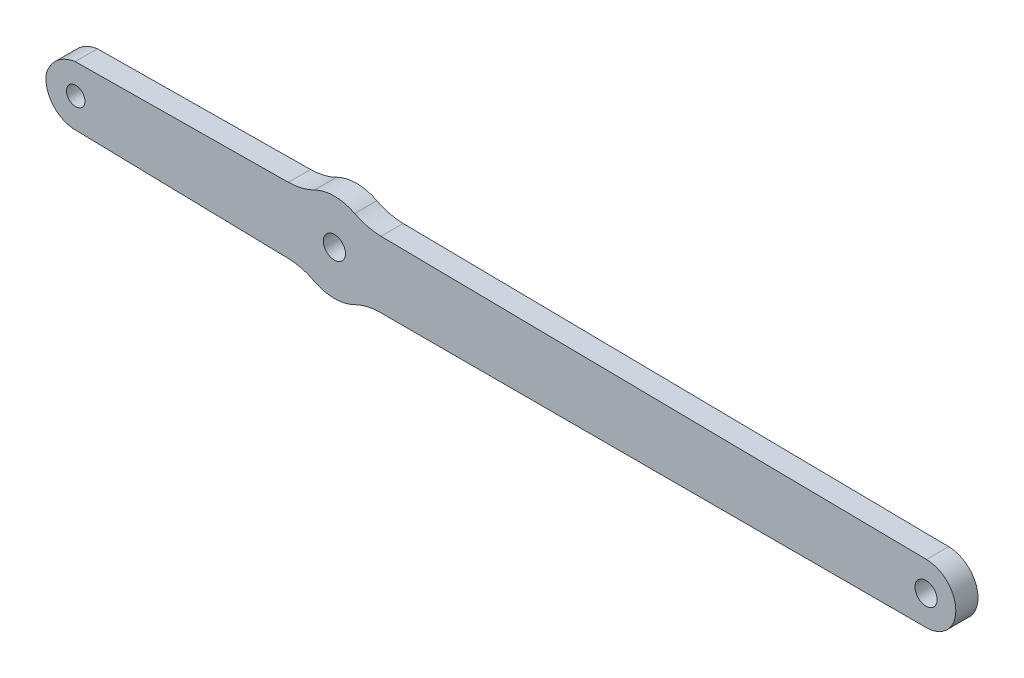
ISO-10303-21;
HEADER;
FILE_DESCRIPTION(('STEP AP214'),'2;1');
FILE_NAME('part.step','',(''),(''),'','','');
FILE_SCHEMA(('AUTOMOTIVE_DESIGN { 1 0 10303 214 1 1 1 1 }'));
ENDSEC;
DATA;
#1=APPLICATION_CONTEXT('core data for automotive mechanical design processes');
#2=APPLICATION_PROTOCOL_DEFINITION('international standard','automotive_design',2000,#1);
#3=PRODUCT_CONTEXT('',#1,'mechanical');
#4=PRODUCT('Part','Part','',(#3));
#5=PRODUCT_RELATED_PRODUCT_CATEGORY('part','',(#4));
#6=PRODUCT_DEFINITION_FORMATION('','',#4);
#7=PRODUCT_DEFINITION_CONTEXT('part definition',#1,'design');
#8=PRODUCT_DEFINITION('design','',#6,#7);
#9=PRODUCT_DEFINITION_SHAPE('','',#8);
#10=(LENGTH_UNIT() NAMED_UNIT(*) SI_UNIT(.MILLI.,.METRE.));
#11=(NAMED_UNIT(*) PLANE_ANGLE_UNIT() SI_UNIT($,.RADIAN.));
#12=(NAMED_UNIT(*) SI_UNIT($,.STERADIAN.) SOLID_ANGLE_UNIT());
#13=UNCERTAINTY_MEASURE_WITH_UNIT(LENGTH_MEASURE(1.E-05),#10,'distance_accuracy_value','');
#14=(GEOMETRIC_REPRESENTATION_CONTEXT(3) GLOBAL_UNCERTAINTY_ASSIGNED_CONTEXT((#13)) GLOBAL_UNIT_ASSIGNED_CONTEXT((#10,
#11,#12)) REPRESENTATION_CONTEXT('',''));
#15=CARTESIAN_POINT('',(0.,0.,0.));
#16=DIRECTION('',(0.,0.,1.));
#17=DIRECTION('',(1.,0.,0.));
#18=AXIS2_PLACEMENT_3D('',#15,#16,#17);
#19=CARTESIAN_POINT('',(2440.21296104026,1644.52332805151,3.));
#20=DIRECTION('',(0.,0.,1.));
#21=DIRECTION('',(1.,0.,0.));
#22=AXIS2_PLACEMENT_3D('',#19,#20,#21);
#23=PLANE('',#22);
#24=CARTESIAN_POINT('',(2325.21536104526,1645.27942804984,3.));
#25=DIRECTION('',(0.,0.,1.));
#26=DIRECTION('',(1.,0.,0.));
#27=AXIS2_PLACEMENT_3D('',#24,#25,#26);
#28=CIRCLE('',#27,1.25000000000008);
#29=CARTESIAN_POINT('',(2326.46536104526,1645.27942804984,3.));
#30=VERTEX_POINT('',#29);
#31=EDGE_CURVE('E486',#30,#30,#28,.T.);
#32=ORIENTED_EDGE('',*,*,#31,.F.);
#33=EDGE_LOOP('',(#32));
#34=FACE_BOUND('',#33,.T.);
#35=DIRECTION('',(0.9999999979286,6.43645912730383E-05,0.));
#36=VECTOR('',#35,1.);
#37=CARTESIAN_POINT('',(2366.44159291692,1640.51895092669,3.));
#38=LINE('',#37,#36);
#39=CARTESIAN_POINT('',(2366.44159291692,1640.51895092669,3.));
#40=VERTEX_POINT('',#39);
#41=CARTESIAN_POINT('',(2440.239407081,1640.52370089284,3.));
#42=VERTEX_POINT('',#41);
#43=EDGE_CURVE('E114',#40,#42,#38,.T.);
#44=ORIENTED_EDGE('',*,*,#43,.T.);
#45=CARTESIAN_POINT('',(2440.21296104026,1644.52332805151,3.));
#46=DIRECTION('',(0.,0.,1.));
#47=DIRECTION('',(1.,0.,0.));
#48=AXIS2_PLACEMENT_3D('',#45,#46,#47);
#49=CIRCLE('',#48,3.99971458999516);
#50=CARTESIAN_POINT('',(2440.23908453395,1648.52295732989,3.));
#51=VERTEX_POINT('',#50);
#52=EDGE_CURVE('E301',#42,#51,#49,.T.);
#53=ORIENTED_EDGE('',*,*,#52,.T.);
#54=DIRECTION('',(-0.999914327574007,0.0130895955713575,0.));
#55=VECTOR('',#54,1.);
#56=CARTESIAN_POINT('',(2440.23908453395,1648.52295732989,3.));
#57=LINE('',#56,#55);
#58=CARTESIAN_POINT('',(2366.50000248119,1649.48825479114,3.));
#59=VERTEX_POINT('',#58);
#60=EDGE_CURVE('E250',#51,#59,#57,.T.);
#61=ORIENTED_EDGE('',*,*,#60,.T.);
#62=CARTESIAN_POINT('',(2366.6049197581,1657.48821129003,3.));
#63=DIRECTION('',(0.,0.,-1.));
#64=DIRECTION('',(1.,0.,0.));
#65=AXIS2_PLACEMENT_3D('',#62,#63,#64);
#66=CIRCLE('',#65,8.00064445024119);
#67=CARTESIAN_POINT('',(2362.93823396365,1650.37725306319,3.));
#68=VERTEX_POINT('',#67);
#69=EDGE_CURVE('E270',#59,#68,#66,.T.);
#70=ORIENTED_EDGE('',*,*,#69,.T.);
#71=CARTESIAN_POINT('',(2360.1883368183,1645.04491457963,3.));
#72=DIRECTION('',(0.,0.,1.));
#73=DIRECTION('',(1.,0.,0.));
#74=AXIS2_PLACEMENT_3D('',#71,#72,#73);
#75=CIRCLE('',#74,5.99964732407257);
#76=CARTESIAN_POINT('',(2357.48930650792,1650.40317954106,3.));
#77=VERTEX_POINT('',#76);
#78=EDGE_CURVE('E266',#68,#77,#75,.T.);
#79=ORIENTED_EDGE('',*,*,#78,.T.);
#80=CARTESIAN_POINT('',(2353.88652881612,1657.56467152541,3.));
#81=DIRECTION('',(0.,0.,-1.));
#82=DIRECTION('',(1.,0.,0.));
#83=AXIS2_PLACEMENT_3D('',#80,#81,#82);
#84=CIRCLE('',#83,8.01666854363158);
#85=CARTESIAN_POINT('',(2353.96721616185,1649.548409049,3.));
#86=VERTEX_POINT('',#85);
#87=EDGE_CURVE('E269',#77,#86,#84,.T.);
#88=ORIENTED_EDGE('',*,*,#87,.T.);
#89=DIRECTION('',(-0.999954125619551,-0.00957844749632703,0.));
#90=VECTOR('',#89,1.);
#91=CARTESIAN_POINT('',(2353.96721616185,1649.548409049,3.));
#92=LINE('',#91,#90);
#93=CARTESIAN_POINT('',(2325.15083428632,1649.27238018552,3.));
#94=VERTEX_POINT('',#93);
#95=EDGE_CURVE('E274',#86,#94,#92,.T.);
#96=ORIENTED_EDGE('',*,*,#95,.T.);
#97=CARTESIAN_POINT('',(2325.78889121728,1644.5594471077,3.));
#98=DIRECTION('',(0.,0.,1.));
#99=DIRECTION('',(1.,0.,0.));
#100=AXIS2_PLACEMENT_3D('',#97,#98,#99);
#101=CIRCLE('',#100,4.75592838919185);
#102=CARTESIAN_POINT('',(2321.25498951292,1645.99561916505,3.));
#103=VERTEX_POINT('',#102);
#104=EDGE_CURVE('E281',#94,#103,#101,.T.);
#105=ORIENTED_EDGE('',*,*,#104,.T.);
#106=CARTESIAN_POINT('',(2325.18909853075,1645.27255959542,3.));
#107=DIRECTION('',(0.,0.,1.));
#108=DIRECTION('',(1.,0.,0.));
#109=AXIS2_PLACEMENT_3D('',#106,#107,#108);
#110=CIRCLE('',#109,4.00000361317313);
#111=CARTESIAN_POINT('',(2325.09872872289,1641.27357694939,3.));
#112=VERTEX_POINT('',#111);
#113=EDGE_CURVE('E284',#103,#112,#110,.T.);
#114=ORIENTED_EDGE('',*,*,#113,.T.);
#115=DIRECTION('',(0.999744437235561,-0.0226066409833889,0.));
#116=VECTOR('',#115,1.);
#117=CARTESIAN_POINT('',(2325.09872872289,1641.27357694939,3.));
#118=LINE('',#117,#116);
#119=CARTESIAN_POINT('',(2353.90906947594,1640.62210542752,3.));
#120=VERTEX_POINT('',#119);
#121=EDGE_CURVE('E149',#112,#120,#118,.T.);
#122=ORIENTED_EDGE('',*,*,#121,.T.);
#123=CARTESIAN_POINT('',(2353.84450791812,1633.07764565918,3.));
#124=DIRECTION('',(0.,0.,-1.));
#125=DIRECTION('',(1.,0.,0.));
#126=AXIS2_PLACEMENT_3D('',#123,#124,#125);
#127=CIRCLE('',#126,7.54473600537389);
#128=CARTESIAN_POINT('',(2357.41978135214,1639.72147446965,3.));
#129=VERTEX_POINT('',#128);
#130=EDGE_CURVE('E143',#120,#129,#127,.T.);
#131=ORIENTED_EDGE('',*,*,#130,.T.);
#132=CARTESIAN_POINT('',(2360.18834368888,1645.04457088387,3.));
#133=DIRECTION('',(0.,0.,1.));
#134=DIRECTION('',(1.,0.,0.));
#135=AXIS2_PLACEMENT_3D('',#132,#133,#134);
#136=CIRCLE('',#135,6.00002440391097);
#137=CARTESIAN_POINT('',(2362.86855878802,1639.67644831915,3.));
#138=VERTEX_POINT('',#137);
#139=EDGE_CURVE('E147',#129,#138,#136,.T.);
#140=ORIENTED_EDGE('',*,*,#139,.T.);
#141=CARTESIAN_POINT('',(2366.44225206849,1632.51832650636,3.));
#142=DIRECTION('',(0.,0.,-1.));
#143=DIRECTION('',(1.,0.,0.));
#144=AXIS2_PLACEMENT_3D('',#141,#142,#143);
#145=CIRCLE('',#144,8.00062444748284);
#146=EDGE_CURVE('E57',#138,#40,#145,.T.);
#147=ORIENTED_EDGE('',*,*,#146,.T.);
#148=EDGE_LOOP('',(#44,#53,#61,#70,#79,#88,#96,#105,#114,#122,#131,#140,#147));
#149=FACE_BOUND('',#148,.T.);
#150=CARTESIAN_POINT('',(2440.18667689334,1644.52335089235,3.));
#151=DIRECTION('',(0.,0.,1.));
#152=DIRECTION('',(1.,0.,0.));
#153=AXIS2_PLACEMENT_3D('',#150,#151,#152);
#154=CIRCLE('',#153,1.50000000000011);
#155=CARTESIAN_POINT('',(2441.68667689334,1644.52335089235,3.));
#156=VERTEX_POINT('',#155);
#157=EDGE_CURVE('E174',#156,#156,#154,.T.);
#158=ORIENTED_EDGE('',*,*,#157,.F.);
#159=EDGE_LOOP('',(#158));
#160=FACE_BOUND('',#159,.T.);
#161=CARTESIAN_POINT('',(2360.18839598004,1645.04459046653,3.));
#162=DIRECTION('',(0.,0.,1.));
#163=DIRECTION('',(1.,0.,0.));
#164=AXIS2_PLACEMENT_3D('',#161,#162,#163);
#165=CIRCLE('',#164,1.50000000000011);
#166=CARTESIAN_POINT('',(2361.68839598004,1645.04459046653,3.));
#167=VERTEX_POINT('',#166);
#168=EDGE_CURVE('E475',#167,#167,#165,.T.);
#169=ORIENTED_EDGE('',*,*,#168,.F.);
#170=EDGE_LOOP('',(#169));
#171=FACE_BOUND('',#170,.T.);
#172=ADVANCED_FACE('F39',(#34,#149,#160,#171),#23,.T.);
#173=CARTESIAN_POINT('',(2440.21296104026,1644.52332805151,0.));
#174=DIRECTION('',(0.,0.,1.));
#175=DIRECTION('',(1.,0.,0.));
#176=AXIS2_PLACEMENT_3D('',#173,#174,#175);
#177=PLANE('',#176);
#178=DIRECTION('',(0.9999999979286,6.43645909722801E-05,0.));
#179=VECTOR('',#178,1.);
#180=CARTESIAN_POINT('',(2432.73939323316,1640.52321815752,0.));
#181=LINE('',#180,#179);
#182=CARTESIAN_POINT('',(2366.44159291692,1640.51895092669,0.));
#183=VERTEX_POINT('',#182);
#184=CARTESIAN_POINT('',(2440.239407081,1640.52370089284,0.));
#185=VERTEX_POINT('',#184);
#186=EDGE_CURVE('E108',#183,#185,#181,.T.);
#187=ORIENTED_EDGE('',*,*,#186,.F.);
#188=CARTESIAN_POINT('',(2366.44225206849,1632.51832650636,0.));
#189=DIRECTION('',(0.,0.,-1.));
#190=DIRECTION('',(1.,0.,0.));
#191=AXIS2_PLACEMENT_3D('',#188,#189,#190);
#192=CIRCLE('',#191,8.00062444748284);
#193=CARTESIAN_POINT('',(2362.86855878802,1639.67644831915,0.));
#194=VERTEX_POINT('',#193);
#195=EDGE_CURVE('E205',#194,#183,#192,.T.);
#196=ORIENTED_EDGE('',*,*,#195,.F.);
#197=CARTESIAN_POINT('',(2360.18834368888,1645.04457088387,0.));
#198=DIRECTION('',(0.,0.,1.));
#199=DIRECTION('',(1.,0.,0.));
#200=AXIS2_PLACEMENT_3D('',#197,#198,#199);
#201=CIRCLE('',#200,6.00002440391097);
#202=CARTESIAN_POINT('',(2357.41978135214,1639.72147446965,0.));
#203=VERTEX_POINT('',#202);
#204=EDGE_CURVE('E101',#203,#194,#201,.T.);
#205=ORIENTED_EDGE('',*,*,#204,.F.);
#206=CARTESIAN_POINT('',(2353.84450791812,1633.07764565918,0.));
#207=DIRECTION('',(0.,0.,-1.));
#208=DIRECTION('',(1.,0.,0.));
#209=AXIS2_PLACEMENT_3D('',#206,#207,#208);
#210=CIRCLE('',#209,7.54473600537389);
#211=CARTESIAN_POINT('',(2353.90906947594,1640.62210542752,0.));
#212=VERTEX_POINT('',#211);
#213=EDGE_CURVE('E158',#212,#203,#210,.T.);
#214=ORIENTED_EDGE('',*,*,#213,.F.);
#215=DIRECTION('',(0.999744437235561,-0.0226066409833889,0.));
#216=VECTOR('',#215,1.);
#217=CARTESIAN_POINT('',(2325.09872872289,1641.27357694939,0.));
#218=LINE('',#217,#216);
#219=CARTESIAN_POINT('',(2325.09872872289,1641.27357694939,0.));
#220=VERTEX_POINT('',#219);
#221=EDGE_CURVE('E198',#220,#212,#218,.T.);
#222=ORIENTED_EDGE('',*,*,#221,.F.);
#223=CARTESIAN_POINT('',(2325.18909853075,1645.27255959542,0.));
#224=DIRECTION('',(0.,0.,1.));
#225=DIRECTION('',(1.,0.,0.));
#226=AXIS2_PLACEMENT_3D('',#223,#224,#225);
#227=CIRCLE('',#226,4.00000361317313);
#228=CARTESIAN_POINT('',(2321.25498951292,1645.99561916505,0.));
#229=VERTEX_POINT('',#228);
#230=EDGE_CURVE('E195',#229,#220,#227,.T.);
#231=ORIENTED_EDGE('',*,*,#230,.F.);
#232=CARTESIAN_POINT('',(2325.78889121728,1644.5594471077,0.));
#233=DIRECTION('',(0.,0.,1.));
#234=DIRECTION('',(1.,0.,0.));
#235=AXIS2_PLACEMENT_3D('',#232,#233,#234);
#236=CIRCLE('',#235,4.75592838919185);
#237=CARTESIAN_POINT('',(2325.15083428632,1649.27238018552,0.));
#238=VERTEX_POINT('',#237);
#239=EDGE_CURVE('E192',#238,#229,#236,.T.);
#240=ORIENTED_EDGE('',*,*,#239,.F.);
#241=DIRECTION('',(-0.999954125619551,-0.00957844749632703,0.));
#242=VECTOR('',#241,1.);
#243=CARTESIAN_POINT('',(2353.96721616185,1649.548409049,0.));
#244=LINE('',#243,#242);
#245=CARTESIAN_POINT('',(2353.96721616185,1649.548409049,0.));
#246=VERTEX_POINT('',#245);
#247=EDGE_CURVE('E189',#246,#238,#244,.T.);
#248=ORIENTED_EDGE('',*,*,#247,.F.);
#249=CARTESIAN_POINT('',(2353.88652881612,1657.56467152541,0.));
#250=DIRECTION('',(0.,0.,-1.));
#251=DIRECTION('',(1.,0.,0.));
#252=AXIS2_PLACEMENT_3D('',#249,#250,#251);
#253=CIRCLE('',#252,8.01666854363158);
#254=CARTESIAN_POINT('',(2357.48930650792,1650.40317954106,0.));
#255=VERTEX_POINT('',#254);
#256=EDGE_CURVE('E186',#255,#246,#253,.T.);
#257=ORIENTED_EDGE('',*,*,#256,.F.);
#258=CARTESIAN_POINT('',(2360.1883368183,1645.04491457963,0.));
#259=DIRECTION('',(0.,0.,1.));
#260=DIRECTION('',(1.,0.,0.));
#261=AXIS2_PLACEMENT_3D('',#258,#259,#260);
#262=CIRCLE('',#261,5.99964732407257);
#263=CARTESIAN_POINT('',(2362.93823396365,1650.37725306319,0.));
#264=VERTEX_POINT('',#263);
#265=EDGE_CURVE('E183',#264,#255,#262,.T.);
#266=ORIENTED_EDGE('',*,*,#265,.F.);
#267=CARTESIAN_POINT('',(2366.6049197581,1657.48821129003,0.));
#268=DIRECTION('',(0.,0.,-1.));
#269=DIRECTION('',(1.,0.,0.));
#270=AXIS2_PLACEMENT_3D('',#267,#268,#269);
#271=CIRCLE('',#270,8.00064445024119);
#272=CARTESIAN_POINT('',(2366.50000248119,1649.48825479114,0.));
#273=VERTEX_POINT('',#272);
#274=EDGE_CURVE('E180',#273,#264,#271,.T.);
#275=ORIENTED_EDGE('',*,*,#274,.F.);
#276=DIRECTION('',(-0.999914327574007,0.0130895955713575,0.));
#277=VECTOR('',#276,1.);
#278=CARTESIAN_POINT('',(2440.23908453395,1648.52295732989,0.));
#279=LINE('',#278,#277);
#280=CARTESIAN_POINT('',(2440.23908453395,1648.52295732989,0.));
#281=VERTEX_POINT('',#280);
#282=EDGE_CURVE('E177',#281,#273,#279,.T.);
#283=ORIENTED_EDGE('',*,*,#282,.F.);
#284=CARTESIAN_POINT('',(2440.21296104026,1644.52332805151,0.));
#285=DIRECTION('',(0.,0.,1.));
#286=DIRECTION('',(1.,0.,0.));
#287=AXIS2_PLACEMENT_3D('',#284,#285,#286);
#288=CIRCLE('',#287,3.99971458999516);
#289=EDGE_CURVE('E173',#185,#281,#288,.T.);
#290=ORIENTED_EDGE('',*,*,#289,.F.);
#291=EDGE_LOOP('',(#187,#196,#205,#214,#222,#231,#240,#248,#257,#266,#275,#283,#290));
#292=FACE_BOUND('',#291,.T.);
#293=CARTESIAN_POINT('',(2440.18667689334,1644.52335089235,0.));
#294=DIRECTION('',(0.,0.,1.));
#295=DIRECTION('',(1.,0.,0.));
#296=AXIS2_PLACEMENT_3D('',#293,#294,#295);
#297=CIRCLE('',#296,1.50000000000011);
#298=CARTESIAN_POINT('',(2441.68667689334,1644.52335089235,0.));
#299=VERTEX_POINT('',#298);
#300=EDGE_CURVE('E306',#299,#299,#297,.T.);
#301=ORIENTED_EDGE('',*,*,#300,.T.);
#302=EDGE_LOOP('',(#301));
#303=FACE_BOUND('',#302,.T.);
#304=CARTESIAN_POINT('',(2325.21536104526,1645.27942804984,0.));
#305=DIRECTION('',(0.,0.,1.));
#306=DIRECTION('',(1.,0.,0.));
#307=AXIS2_PLACEMENT_3D('',#304,#305,#306);
#308=CIRCLE('',#307,1.25000000000008);
#309=CARTESIAN_POINT('',(2326.46536104526,1645.27942804984,0.));
#310=VERTEX_POINT('',#309);
#311=EDGE_CURVE('E483',#310,#310,#308,.T.);
#312=ORIENTED_EDGE('',*,*,#311,.T.);
#313=EDGE_LOOP('',(#312));
#314=FACE_BOUND('',#313,.T.);
#315=CARTESIAN_POINT('',(2360.18839598004,1645.04459046653,0.));
#316=DIRECTION('',(0.,0.,1.));
#317=DIRECTION('',(1.,0.,0.));
#318=AXIS2_PLACEMENT_3D('',#315,#316,#317);
#319=CIRCLE('',#318,1.50000000000011);
#320=CARTESIAN_POINT('',(2361.68839598004,1645.04459046653,0.));
#321=VERTEX_POINT('',#320);
#322=EDGE_CURVE('E478',#321,#321,#319,.T.);
#323=ORIENTED_EDGE('',*,*,#322,.T.);
#324=EDGE_LOOP('',(#323));
#325=FACE_BOUND('',#324,.T.);
#326=ADVANCED_FACE('F254',(#292,#303,#314,#325),#177,.F.);
#327=CARTESIAN_POINT('',(2432.73939323316,1640.52321815752,3.));
#328=DIRECTION('',(-6.43645909722801E-05,0.9999999979286,0.));
#329=DIRECTION('',(-0.9999999979286,-6.43645909722801E-05,0.));
#330=AXIS2_PLACEMENT_3D('',#327,#328,#329);
#331=PLANE('',#330);
#332=ORIENTED_EDGE('',*,*,#186,.T.);
#333=DIRECTION('',(0.,0.,-1.));
#334=VECTOR('',#333,1.);
#335=CARTESIAN_POINT('',(2440.239407081,1640.52370089284,3.));
#336=LINE('',#335,#334);
#337=EDGE_CURVE('E11',#42,#185,#336,.T.);
#338=ORIENTED_EDGE('',*,*,#337,.F.);
#339=ORIENTED_EDGE('',*,*,#43,.F.);
#340=DIRECTION('',(0.,0.,-1.));
#341=VECTOR('',#340,1.);
#342=CARTESIAN_POINT('',(2366.44159291692,1640.51895092669,3.));
#343=LINE('',#342,#341);
#344=EDGE_CURVE('E167',#40,#183,#343,.T.);
#345=ORIENTED_EDGE('',*,*,#344,.T.);
#346=EDGE_LOOP('',(#332,#338,#339,#345));
#347=FACE_BOUND('',#346,.T.);
#348=ADVANCED_FACE('F41',(#347),#331,.F.);
#349=CARTESIAN_POINT('',(2440.21296104026,1644.52332805151,3.));
#350=DIRECTION('',(0.,0.,-1.));
#351=DIRECTION('',(-1.,0.,0.));
#352=AXIS2_PLACEMENT_3D('',#349,#350,#351);
#353=CYLINDRICAL_SURFACE('',#352,3.99971458999516);
#354=ORIENTED_EDGE('',*,*,#289,.T.);
#355=DIRECTION('',(0.,0.,-1.));
#356=VECTOR('',#355,1.);
#357=CARTESIAN_POINT('',(2440.23908453395,1648.52295732989,3.));
#358=LINE('',#357,#356);
#359=EDGE_CURVE('E49',#51,#281,#358,.T.);
#360=ORIENTED_EDGE('',*,*,#359,.F.);
#361=ORIENTED_EDGE('',*,*,#52,.F.);
#362=ORIENTED_EDGE('',*,*,#337,.T.);
#363=EDGE_LOOP('',(#354,#360,#361,#362));
#364=FACE_BOUND('',#363,.T.);
#365=ADVANCED_FACE('F309',(#364),#353,.T.);
#366=CARTESIAN_POINT('',(2440.23908453395,1648.52295732989,3.));
#367=DIRECTION('',(-0.0130895955713575,-0.999914327574007,0.));
#368=DIRECTION('',(0.999914327574007,-0.0130895955713575,0.));
#369=AXIS2_PLACEMENT_3D('',#366,#367,#368);
#370=PLANE('',#369);
#371=ORIENTED_EDGE('',*,*,#282,.T.);
#372=DIRECTION('',(0.,0.,-1.));
#373=VECTOR('',#372,1.);
#374=CARTESIAN_POINT('',(2366.50000248119,1649.48825479114,3.));
#375=LINE('',#374,#373);
#376=EDGE_CURVE('E239',#59,#273,#375,.T.);
#377=ORIENTED_EDGE('',*,*,#376,.F.);
#378=ORIENTED_EDGE('',*,*,#60,.F.);
#379=ORIENTED_EDGE('',*,*,#359,.T.);
#380=EDGE_LOOP('',(#371,#377,#378,#379));
#381=FACE_BOUND('',#380,.T.);
#382=ADVANCED_FACE('F248',(#381),#370,.F.);
#383=CARTESIAN_POINT('',(2366.6049197581,1657.48821129003,3.));
#384=DIRECTION('',(0.,0.,-1.));
#385=DIRECTION('',(-1.,0.,0.));
#386=AXIS2_PLACEMENT_3D('',#383,#384,#385);
#387=CYLINDRICAL_SURFACE('',#386,8.00064445024119);
#388=ORIENTED_EDGE('',*,*,#274,.T.);
#389=DIRECTION('',(0.,0.,-1.));
#390=VECTOR('',#389,1.);
#391=CARTESIAN_POINT('',(2362.93823396365,1650.37725306319,3.));
#392=LINE('',#391,#390);
#393=EDGE_CURVE('E235',#68,#264,#392,.T.);
#394=ORIENTED_EDGE('',*,*,#393,.F.);
#395=ORIENTED_EDGE('',*,*,#69,.F.);
#396=ORIENTED_EDGE('',*,*,#376,.T.);
#397=EDGE_LOOP('',(#388,#394,#395,#396));
#398=FACE_BOUND('',#397,.T.);
#399=ADVANCED_FACE('F260',(#398),#387,.F.);
#400=CARTESIAN_POINT('',(2360.1883368183,1645.04491457963,3.));
#401=DIRECTION('',(0.,0.,-1.));
#402=DIRECTION('',(-1.,0.,0.));
#403=AXIS2_PLACEMENT_3D('',#400,#401,#402);
#404=CYLINDRICAL_SURFACE('',#403,5.99964732407257);
#405=ORIENTED_EDGE('',*,*,#265,.T.);
#406=DIRECTION('',(0.,0.,-1.));
#407=VECTOR('',#406,1.);
#408=CARTESIAN_POINT('',(2357.48930650792,1650.40317954106,3.));
#409=LINE('',#408,#407);
#410=EDGE_CURVE('E231',#77,#255,#409,.T.);
#411=ORIENTED_EDGE('',*,*,#410,.F.);
#412=ORIENTED_EDGE('',*,*,#78,.F.);
#413=ORIENTED_EDGE('',*,*,#393,.T.);
#414=EDGE_LOOP('',(#405,#411,#412,#413));
#415=FACE_BOUND('',#414,.T.);
#416=ADVANCED_FACE('F264',(#415),#404,.T.);
#417=CARTESIAN_POINT('',(2353.88652881612,1657.56467152541,3.));
#418=DIRECTION('',(0.,0.,-1.));
#419=DIRECTION('',(-1.,0.,0.));
#420=AXIS2_PLACEMENT_3D('',#417,#418,#419);
#421=CYLINDRICAL_SURFACE('',#420,8.01666854363158);
#422=ORIENTED_EDGE('',*,*,#256,.T.);
#423=DIRECTION('',(0.,0.,-1.));
#424=VECTOR('',#423,1.);
#425=CARTESIAN_POINT('',(2353.96721616185,1649.548409049,3.));
#426=LINE('',#425,#424);
#427=EDGE_CURVE('E227',#86,#246,#426,.T.);
#428=ORIENTED_EDGE('',*,*,#427,.F.);
#429=ORIENTED_EDGE('',*,*,#87,.F.);
#430=ORIENTED_EDGE('',*,*,#410,.T.);
#431=EDGE_LOOP('',(#422,#428,#429,#430));
#432=FACE_BOUND('',#431,.T.);
#433=ADVANCED_FACE('F345',(#432),#421,.F.);
#434=CARTESIAN_POINT('',(2353.96721616185,1649.548409049,3.));
#435=DIRECTION('',(0.00957844749632703,-0.999954125619551,0.));
#436=DIRECTION('',(0.999954125619551,0.00957844749632703,0.));
#437=AXIS2_PLACEMENT_3D('',#434,#435,#436);
#438=PLANE('',#437);
#439=ORIENTED_EDGE('',*,*,#247,.T.);
#440=DIRECTION('',(0.,0.,-1.));
#441=VECTOR('',#440,1.);
#442=CARTESIAN_POINT('',(2325.15083428632,1649.27238018552,3.));
#443=LINE('',#442,#441);
#444=EDGE_CURVE('E223',#94,#238,#443,.T.);
#445=ORIENTED_EDGE('',*,*,#444,.F.);
#446=ORIENTED_EDGE('',*,*,#95,.F.);
#447=ORIENTED_EDGE('',*,*,#427,.T.);
#448=EDGE_LOOP('',(#439,#445,#446,#447));
#449=FACE_BOUND('',#448,.T.);
#450=ADVANCED_FACE('F341',(#449),#438,.F.);
#451=CARTESIAN_POINT('',(2325.78889121728,1644.5594471077,3.));
#452=DIRECTION('',(0.,0.,-1.));
#453=DIRECTION('',(-1.,0.,0.));
#454=AXIS2_PLACEMENT_3D('',#451,#452,#453);
#455=CYLINDRICAL_SURFACE('',#454,4.75592838919185);
#456=ORIENTED_EDGE('',*,*,#239,.T.);
#457=DIRECTION('',(0.,0.,-1.));
#458=VECTOR('',#457,1.);
#459=CARTESIAN_POINT('',(2321.25498951292,1645.99561916505,3.));
#460=LINE('',#459,#458);
#461=EDGE_CURVE('E219',#103,#229,#460,.T.);
#462=ORIENTED_EDGE('',*,*,#461,.F.);
#463=ORIENTED_EDGE('',*,*,#104,.F.);
#464=ORIENTED_EDGE('',*,*,#444,.T.);
#465=EDGE_LOOP('',(#456,#462,#463,#464));
#466=FACE_BOUND('',#465,.T.);
#467=ADVANCED_FACE('F338',(#466),#455,.T.);
#468=CARTESIAN_POINT('',(2325.18909853075,1645.27255959542,3.));
#469=DIRECTION('',(0.,0.,-1.));
#470=DIRECTION('',(-1.,0.,0.));
#471=AXIS2_PLACEMENT_3D('',#468,#469,#470);
#472=CYLINDRICAL_SURFACE('',#471,4.00000361317313);
#473=ORIENTED_EDGE('',*,*,#230,.T.);
#474=DIRECTION('',(0.,0.,-1.));
#475=VECTOR('',#474,1.);
#476=CARTESIAN_POINT('',(2325.09872872289,1641.27357694939,3.));
#477=LINE('',#476,#475);
#478=EDGE_CURVE('E215',#112,#220,#477,.T.);
#479=ORIENTED_EDGE('',*,*,#478,.F.);
#480=ORIENTED_EDGE('',*,*,#113,.F.);
#481=ORIENTED_EDGE('',*,*,#461,.T.);
#482=EDGE_LOOP('',(#473,#479,#480,#481));
#483=FACE_BOUND('',#482,.T.);
#484=ADVANCED_FACE('F292',(#483),#472,.T.);
#485=CARTESIAN_POINT('',(2325.09872872289,1641.27357694939,3.));
#486=DIRECTION('',(0.0226066409833889,0.999744437235561,0.));
#487=DIRECTION('',(-0.999744437235561,0.0226066409833889,0.));
#488=AXIS2_PLACEMENT_3D('',#485,#486,#487);
#489=PLANE('',#488);
#490=ORIENTED_EDGE('',*,*,#221,.T.);
#491=DIRECTION('',(0.,0.,-1.));
#492=VECTOR('',#491,1.);
#493=CARTESIAN_POINT('',(2353.90906947594,1640.62210542752,3.));
#494=LINE('',#493,#492);
#495=EDGE_CURVE('E160',#120,#212,#494,.T.);
#496=ORIENTED_EDGE('',*,*,#495,.F.);
#497=ORIENTED_EDGE('',*,*,#121,.F.);
#498=ORIENTED_EDGE('',*,*,#478,.T.);
#499=EDGE_LOOP('',(#490,#496,#497,#498));
#500=FACE_BOUND('',#499,.T.);
#501=ADVANCED_FACE('F296',(#500),#489,.F.);
#502=CARTESIAN_POINT('',(2353.84450791812,1633.07764565918,3.));
#503=DIRECTION('',(0.,0.,-1.));
#504=DIRECTION('',(-1.,0.,0.));
#505=AXIS2_PLACEMENT_3D('',#502,#503,#504);
#506=CYLINDRICAL_SURFACE('',#505,7.54473600537389);
#507=ORIENTED_EDGE('',*,*,#213,.T.);
#508=DIRECTION('',(0.,0.,-1.));
#509=VECTOR('',#508,1.);
#510=CARTESIAN_POINT('',(2357.41978135214,1639.72147446965,3.));
#511=LINE('',#510,#509);
#512=EDGE_CURVE('E155',#129,#203,#511,.T.);
#513=ORIENTED_EDGE('',*,*,#512,.F.);
#514=ORIENTED_EDGE('',*,*,#130,.F.);
#515=ORIENTED_EDGE('',*,*,#495,.T.);
#516=EDGE_LOOP('',(#507,#513,#514,#515));
#517=FACE_BOUND('',#516,.T.);
#518=ADVANCED_FACE('F156',(#517),#506,.F.);
#519=CARTESIAN_POINT('',(2360.18834368888,1645.04457088387,3.));
#520=DIRECTION('',(0.,0.,-1.));
#521=DIRECTION('',(-1.,0.,0.));
#522=AXIS2_PLACEMENT_3D('',#519,#520,#521);
#523=CYLINDRICAL_SURFACE('',#522,6.00002440391097);
#524=ORIENTED_EDGE('',*,*,#204,.T.);
#525=DIRECTION('',(0.,0.,-1.));
#526=VECTOR('',#525,1.);
#527=CARTESIAN_POINT('',(2362.86855878802,1639.67644831915,3.));
#528=LINE('',#527,#526);
#529=EDGE_CURVE('E161',#138,#194,#528,.T.);
#530=ORIENTED_EDGE('',*,*,#529,.F.);
#531=ORIENTED_EDGE('',*,*,#139,.F.);
#532=ORIENTED_EDGE('',*,*,#512,.T.);
#533=EDGE_LOOP('',(#524,#530,#531,#532));
#534=FACE_BOUND('',#533,.T.);
#535=ADVANCED_FACE('F163',(#534),#523,.T.);
#536=CARTESIAN_POINT('',(2366.44225206849,1632.51832650636,3.));
#537=DIRECTION('',(0.,0.,-1.));
#538=DIRECTION('',(-1.,0.,0.));
#539=AXIS2_PLACEMENT_3D('',#536,#537,#538);
#540=CYLINDRICAL_SURFACE('',#539,8.00062444748284);
#541=ORIENTED_EDGE('',*,*,#195,.T.);
#542=ORIENTED_EDGE('',*,*,#344,.F.);
#543=ORIENTED_EDGE('',*,*,#146,.F.);
#544=ORIENTED_EDGE('',*,*,#529,.T.);
#545=EDGE_LOOP('',(#541,#542,#543,#544));
#546=FACE_BOUND('',#545,.T.);
#547=ADVANCED_FACE('F298',(#546),#540,.F.);
#548=CARTESIAN_POINT('',(2440.18667689334,1644.52335089235,3.));
#549=DIRECTION('',(0.,0.,-1.));
#550=DIRECTION('',(-1.,0.,0.));
#551=AXIS2_PLACEMENT_3D('',#548,#549,#550);
#552=CYLINDRICAL_SURFACE('',#551,1.50000000000011);
#553=ORIENTED_EDGE('',*,*,#157,.T.);
#554=EDGE_LOOP('',(#553));
#555=FACE_BOUND('',#554,.T.);
#556=ORIENTED_EDGE('',*,*,#300,.F.);
#557=EDGE_LOOP('',(#556));
#558=FACE_BOUND('',#557,.T.);
#559=ADVANCED_FACE('F325',(#555,#558),#552,.F.);
#560=CARTESIAN_POINT('',(2325.21536104526,1645.27942804984,3.));
#561=DIRECTION('',(0.,0.,-1.));
#562=DIRECTION('',(-1.,0.,0.));
#563=AXIS2_PLACEMENT_3D('',#560,#561,#562);
#564=CYLINDRICAL_SURFACE('',#563,1.25000000000008);
#565=ORIENTED_EDGE('',*,*,#31,.T.);
#566=EDGE_LOOP('',(#565));
#567=FACE_BOUND('',#566,.T.);
#568=ORIENTED_EDGE('',*,*,#311,.F.);
#569=EDGE_LOOP('',(#568));
#570=FACE_BOUND('',#569,.T.);
#571=ADVANCED_FACE('F399',(#567,#570),#564,.F.);
#572=CARTESIAN_POINT('',(2360.18839598004,1645.04459046653,3.));
#573=DIRECTION('',(0.,0.,-1.));
#574=DIRECTION('',(-1.,0.,0.));
#575=AXIS2_PLACEMENT_3D('',#572,#573,#574);
#576=CYLINDRICAL_SURFACE('',#575,1.50000000000011);
#577=ORIENTED_EDGE('',*,*,#168,.T.);
#578=EDGE_LOOP('',(#577));
#579=FACE_BOUND('',#578,.T.);
#580=ORIENTED_EDGE('',*,*,#322,.F.);
#581=EDGE_LOOP('',(#580));
#582=FACE_BOUND('',#581,.T.);
#583=ADVANCED_FACE('F406',(#579,#582),#576,.F.);
#584=CLOSED_SHELL('',(#172,#326,#348,#365,#382,#399,#416,#433,#450,#467,#484,#501,#518,#535,
#547,#559,#571,#583));
#585=MANIFOLD_SOLID_BREP('B2',#584);
#586=ADVANCED_BREP_SHAPE_REPRESENTATION('',(#18,#585),#14);
#587=SHAPE_DEFINITION_REPRESENTATION(#9,#586);
ENDSEC;
END-ISO-10303-21;
